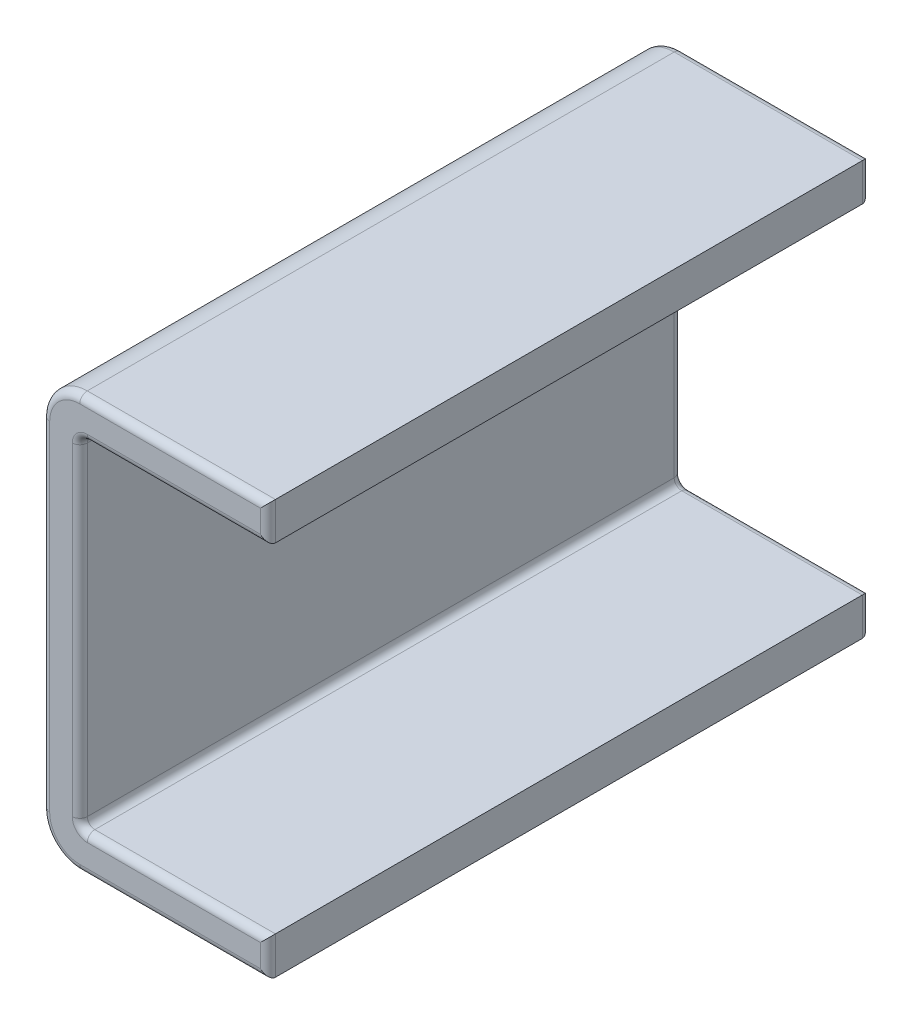
ISO-10303-21;
HEADER;
FILE_DESCRIPTION(('STEP AP214'),'2;1');
FILE_NAME('part.step','',(''),(''),'','','');
FILE_SCHEMA(('AUTOMOTIVE_DESIGN { 1 0 10303 214 1 1 1 1 }'));
ENDSEC;
DATA;
#1=APPLICATION_CONTEXT('core data for automotive mechanical design processes');
#2=APPLICATION_PROTOCOL_DEFINITION('international standard','automotive_design',2000,#1);
#3=PRODUCT_CONTEXT('',#1,'mechanical');
#4=PRODUCT('Part','Part','',(#3));
#5=PRODUCT_RELATED_PRODUCT_CATEGORY('part','',(#4));
#6=PRODUCT_DEFINITION_FORMATION('','',#4);
#7=PRODUCT_DEFINITION_CONTEXT('part definition',#1,'design');
#8=PRODUCT_DEFINITION('design','',#6,#7);
#9=PRODUCT_DEFINITION_SHAPE('','',#8);
#10=(LENGTH_UNIT() NAMED_UNIT(*) SI_UNIT(.MILLI.,.METRE.));
#11=(NAMED_UNIT(*) PLANE_ANGLE_UNIT() SI_UNIT($,.RADIAN.));
#12=(NAMED_UNIT(*) SI_UNIT($,.STERADIAN.) SOLID_ANGLE_UNIT());
#13=UNCERTAINTY_MEASURE_WITH_UNIT(LENGTH_MEASURE(1.E-05),#10,'distance_accuracy_value','');
#14=(GEOMETRIC_REPRESENTATION_CONTEXT(3) GLOBAL_UNCERTAINTY_ASSIGNED_CONTEXT((#13)) GLOBAL_UNIT_ASSIGNED_CONTEXT((#10,
#11,#12)) REPRESENTATION_CONTEXT('',''));
#15=CARTESIAN_POINT('',(0.,0.,0.));
#16=DIRECTION('',(0.,0.,1.));
#17=DIRECTION('',(1.,0.,0.));
#18=AXIS2_PLACEMENT_3D('',#15,#16,#17);
#19=CARTESIAN_POINT('',(-0.273602376485,0.,0.));
#20=DIRECTION('',(0.,-1.,0.));
#21=DIRECTION('',(0.,0.,-1.));
#22=AXIS2_PLACEMENT_3D('',#19,#20,#21);
#23=PLANE('',#22);
#24=DIRECTION('',(1.,0.,0.));
#25=VECTOR('',#24,1.);
#26=CARTESIAN_POINT('',(-0.221329649212,0.,0.79));
#27=LINE('',#26,#25);
#28=CARTESIAN_POINT('',(-0.223602376485,0.,0.79));
#29=VERTEX_POINT('',#28);
#30=CARTESIAN_POINT('',(0.02639762351484,0.,0.79));
#31=VERTEX_POINT('',#30);
#32=EDGE_CURVE('E263',#29,#31,#27,.T.);
#33=ORIENTED_EDGE('',*,*,#32,.F.);
#34=DIRECTION('',(0.,0.,1.));
#35=VECTOR('',#34,1.);
#36=CARTESIAN_POINT('',(-0.223602376485,0.,0.));
#37=LINE('',#36,#35);
#38=CARTESIAN_POINT('',(-0.223602376485,0.,0.01));
#39=VERTEX_POINT('',#38);
#40=EDGE_CURVE('E370',#39,#29,#37,.T.);
#41=ORIENTED_EDGE('',*,*,#40,.F.);
#42=DIRECTION('',(-1.,0.,0.));
#43=VECTOR('',#42,1.);
#44=CARTESIAN_POINT('',(-0.221329649212,0.,0.01));
#45=LINE('',#44,#43);
#46=CARTESIAN_POINT('',(0.02639762351484,0.,0.01));
#47=VERTEX_POINT('',#46);
#48=EDGE_CURVE('E265',#47,#39,#45,.T.);
#49=ORIENTED_EDGE('',*,*,#48,.F.);
#50=DIRECTION('',(0.,0.,1.));
#51=VECTOR('',#50,1.);
#52=CARTESIAN_POINT('',(0.02639762351484,0.,0.));
#53=LINE('',#52,#51);
#54=EDGE_CURVE('E11',#47,#31,#53,.T.);
#55=ORIENTED_EDGE('',*,*,#54,.T.);
#56=EDGE_LOOP('',(#33,#41,#49,#55));
#57=FACE_BOUND('',#56,.T.);
#58=ADVANCED_FACE('F17',(#57),#23,.T.);
#59=CARTESIAN_POINT('',(0.02639762351484,0.,0.));
#60=DIRECTION('',(1.,0.,0.));
#61=DIRECTION('',(0.,1.,0.));
#62=AXIS2_PLACEMENT_3D('',#59,#60,#61);
#63=PLANE('',#62);
#64=DIRECTION('',(0.,1.,0.));
#65=VECTOR('',#64,1.);
#66=CARTESIAN_POINT('',(0.02639762351484,0.1375,0.79));
#67=LINE('',#66,#65);
#68=CARTESIAN_POINT('',(0.02639762351484,0.05,0.79));
#69=VERTEX_POINT('',#68);
#70=EDGE_CURVE('E401',#31,#69,#67,.T.);
#71=ORIENTED_EDGE('',*,*,#70,.F.);
#72=ORIENTED_EDGE('',*,*,#54,.F.);
#73=DIRECTION('',(0.,-1.,0.));
#74=VECTOR('',#73,1.);
#75=CARTESIAN_POINT('',(0.02639762351484,0.1375,0.01));
#76=LINE('',#75,#74);
#77=CARTESIAN_POINT('',(0.02639762351484,0.05,0.01));
#78=VERTEX_POINT('',#77);
#79=EDGE_CURVE('E260',#78,#47,#76,.T.);
#80=ORIENTED_EDGE('',*,*,#79,.F.);
#81=DIRECTION('',(0.,0.,1.));
#82=VECTOR('',#81,1.);
#83=CARTESIAN_POINT('',(0.02639762351484,0.05,0.));
#84=LINE('',#83,#82);
#85=EDGE_CURVE('E28',#78,#69,#84,.T.);
#86=ORIENTED_EDGE('',*,*,#85,.T.);
#87=EDGE_LOOP('',(#71,#72,#80,#86));
#88=FACE_BOUND('',#87,.T.);
#89=ADVANCED_FACE('F671',(#88),#63,.T.);
#90=CARTESIAN_POINT('',(0.02639762351484,0.05,0.));
#91=DIRECTION('',(0.,1.,0.));
#92=DIRECTION('',(1.,0.,0.));
#93=AXIS2_PLACEMENT_3D('',#90,#91,#92);
#94=PLANE('',#93);
#95=DIRECTION('',(-1.,0.,0.));
#96=VECTOR('',#95,1.);
#97=CARTESIAN_POINT('',(-0.07132964921243,0.05,0.79));
#98=LINE('',#97,#96);
#99=CARTESIAN_POINT('',(-0.213602376485,0.05,0.79));
#100=VERTEX_POINT('',#99);
#101=EDGE_CURVE('E316',#69,#100,#98,.T.);
#102=ORIENTED_EDGE('',*,*,#101,.F.);
#103=ORIENTED_EDGE('',*,*,#85,.F.);
#104=DIRECTION('',(1.,0.,0.));
#105=VECTOR('',#104,1.);
#106=CARTESIAN_POINT('',(-0.07132964921243,0.05,0.01));
#107=LINE('',#106,#105);
#108=CARTESIAN_POINT('',(-0.213602376485,0.05,0.01));
#109=VERTEX_POINT('',#108);
#110=EDGE_CURVE('E344',#109,#78,#107,.T.);
#111=ORIENTED_EDGE('',*,*,#110,.F.);
#112=DIRECTION('',(0.,0.,-1.));
#113=VECTOR('',#112,1.);
#114=CARTESIAN_POINT('',(-0.213602376485,0.05,0.));
#115=LINE('',#114,#113);
#116=EDGE_CURVE('E308',#100,#109,#115,.T.);
#117=ORIENTED_EDGE('',*,*,#116,.F.);
#118=EDGE_LOOP('',(#102,#103,#111,#117));
#119=FACE_BOUND('',#118,.T.);
#120=ADVANCED_FACE('F585',(#119),#94,.T.);
#121=CARTESIAN_POINT('',(-0.16905692194,0.275,0.));
#122=DIRECTION('',(0.,0.,1.));
#123=DIRECTION('',(1.,0.,0.));
#124=AXIS2_PLACEMENT_3D('',#121,#122,#123);
#125=PLANE('',#124);
#126=DIRECTION('',(-1.,0.,0.));
#127=VECTOR('',#126,1.);
#128=CARTESIAN_POINT('',(-0.07132964921243,0.54,0.));
#129=LINE('',#128,#127);
#130=CARTESIAN_POINT('',(0.01639762351484,0.54,0.));
#131=VERTEX_POINT('',#130);
#132=CARTESIAN_POINT('',(-0.223602376485,0.54,0.));
#133=VERTEX_POINT('',#132);
#134=EDGE_CURVE('E271',#131,#133,#129,.T.);
#135=ORIENTED_EDGE('',*,*,#134,.F.);
#136=DIRECTION('',(0.,1.,0.));
#137=VECTOR('',#136,1.);
#138=CARTESIAN_POINT('',(0.01639762351484,0.3875,0.));
#139=LINE('',#138,#137);
#140=CARTESIAN_POINT('',(0.01639762351484,0.51,0.));
#141=VERTEX_POINT('',#140);
#142=EDGE_CURVE('E374',#141,#131,#139,.T.);
#143=ORIENTED_EDGE('',*,*,#142,.F.);
#144=DIRECTION('',(1.,0.,0.));
#145=VECTOR('',#144,1.);
#146=CARTESIAN_POINT('',(-0.196329649212,0.51,0.));
#147=LINE('',#146,#145);
#148=CARTESIAN_POINT('',(-0.213602376485,0.51,0.));
#149=VERTEX_POINT('',#148);
#150=EDGE_CURVE('E280',#149,#141,#147,.T.);
#151=ORIENTED_EDGE('',*,*,#150,.F.);
#152=CARTESIAN_POINT('',(-0.213602376485,0.49,0.));
#153=DIRECTION('',(0.,0.,-1.));
#154=DIRECTION('',(-0.707106781186548,0.707106781186548,0.));
#155=AXIS2_PLACEMENT_3D('',#152,#153,#154);
#156=CIRCLE('',#155,0.02);
#157=CARTESIAN_POINT('',(-0.233602376485,0.49,0.));
#158=VERTEX_POINT('',#157);
#159=EDGE_CURVE('E347',#158,#149,#156,.T.);
#160=ORIENTED_EDGE('',*,*,#159,.F.);
#161=DIRECTION('',(0.,1.,0.));
#162=VECTOR('',#161,1.);
#163=CARTESIAN_POINT('',(-0.233602376485,0.1625,0.));
#164=LINE('',#163,#162);
#165=CARTESIAN_POINT('',(-0.233602376485,0.06,0.));
#166=VERTEX_POINT('',#165);
#167=EDGE_CURVE('E383',#166,#158,#164,.T.);
#168=ORIENTED_EDGE('',*,*,#167,.F.);
#169=CARTESIAN_POINT('',(-0.213602376485,0.06,0.));
#170=DIRECTION('',(0.,0.,-1.));
#171=DIRECTION('',(-0.707106781186548,-0.707106781186548,0.));
#172=AXIS2_PLACEMENT_3D('',#169,#170,#171);
#173=CIRCLE('',#172,0.02);
#174=CARTESIAN_POINT('',(-0.213602376485,0.04,0.));
#175=VERTEX_POINT('',#174);
#176=EDGE_CURVE('E285',#175,#166,#173,.T.);
#177=ORIENTED_EDGE('',*,*,#176,.F.);
#178=DIRECTION('',(-1.,0.,0.));
#179=VECTOR('',#178,1.);
#180=CARTESIAN_POINT('',(-0.07132964921243,0.04,0.));
#181=LINE('',#180,#179);
#182=CARTESIAN_POINT('',(0.01639762351484,0.04,0.));
#183=VERTEX_POINT('',#182);
#184=EDGE_CURVE('E303',#183,#175,#181,.T.);
#185=ORIENTED_EDGE('',*,*,#184,.F.);
#186=DIRECTION('',(0.,1.,0.));
#187=VECTOR('',#186,1.);
#188=CARTESIAN_POINT('',(0.01639762351484,0.1375,0.));
#189=LINE('',#188,#187);
#190=CARTESIAN_POINT('',(0.01639762351484,0.01,0.));
#191=VERTEX_POINT('',#190);
#192=EDGE_CURVE('E255',#191,#183,#189,.T.);
#193=ORIENTED_EDGE('',*,*,#192,.F.);
#194=DIRECTION('',(1.,0.,0.));
#195=VECTOR('',#194,1.);
#196=CARTESIAN_POINT('',(-0.221329649212,0.01,0.));
#197=LINE('',#196,#195);
#198=CARTESIAN_POINT('',(-0.223602376485,0.01,0.));
#199=VERTEX_POINT('',#198);
#200=EDGE_CURVE('E269',#199,#191,#197,.T.);
#201=ORIENTED_EDGE('',*,*,#200,.F.);
#202=CARTESIAN_POINT('',(-0.223602376485,0.05,0.));
#203=DIRECTION('',(0.,0.,1.));
#204=DIRECTION('',(-0.707106781186548,-0.707106781186548,0.));
#205=AXIS2_PLACEMENT_3D('',#202,#203,#204);
#206=CIRCLE('',#205,0.04);
#207=CARTESIAN_POINT('',(-0.263602376485,0.05,0.));
#208=VERTEX_POINT('',#207);
#209=EDGE_CURVE('E270',#208,#199,#206,.T.);
#210=ORIENTED_EDGE('',*,*,#209,.F.);
#211=DIRECTION('',(0.,-1.,0.));
#212=VECTOR('',#211,1.);
#213=CARTESIAN_POINT('',(-0.263602376485,0.4125,0.));
#214=LINE('',#213,#212);
#215=CARTESIAN_POINT('',(-0.263602376485,0.5,0.));
#216=VERTEX_POINT('',#215);
#217=EDGE_CURVE('E410',#216,#208,#214,.T.);
#218=ORIENTED_EDGE('',*,*,#217,.F.);
#219=CARTESIAN_POINT('',(-0.223602376485,0.5,0.));
#220=DIRECTION('',(0.,0.,1.));
#221=DIRECTION('',(-0.707106781186548,0.707106781186548,0.));
#222=AXIS2_PLACEMENT_3D('',#219,#220,#221);
#223=CIRCLE('',#222,0.04);
#224=EDGE_CURVE('E366',#133,#216,#223,.T.);
#225=ORIENTED_EDGE('',*,*,#224,.F.);
#226=EDGE_LOOP('',(#135,#143,#151,#160,#168,#177,#185,#193,#201,#210,#218,#225));
#227=FACE_BOUND('',#226,.T.);
#228=ADVANCED_FACE('F516',(#227),#125,.F.);
#229=CARTESIAN_POINT('',(-0.223602376485,0.05,0.));
#230=DIRECTION('',(1.,0.,0.));
#231=DIRECTION('',(0.,1.,0.));
#232=AXIS2_PLACEMENT_3D('',#229,#230,#231);
#233=PLANE('',#232);
#234=DIRECTION('',(0.,-1.,0.));
#235=VECTOR('',#234,1.);
#236=CARTESIAN_POINT('',(-0.223602376485,0.1625,0.01));
#237=LINE('',#236,#235);
#238=CARTESIAN_POINT('',(-0.223602376485,0.49,0.01));
#239=VERTEX_POINT('',#238);
#240=CARTESIAN_POINT('',(-0.223602376485,0.06,0.01));
#241=VERTEX_POINT('',#240);
#242=EDGE_CURVE('E379',#239,#241,#237,.T.);
#243=ORIENTED_EDGE('',*,*,#242,.F.);
#244=DIRECTION('',(0.,0.,-1.));
#245=VECTOR('',#244,1.);
#246=CARTESIAN_POINT('',(-0.223602376485,0.49,0.));
#247=LINE('',#246,#245);
#248=CARTESIAN_POINT('',(-0.223602376485,0.49,0.79));
#249=VERTEX_POINT('',#248);
#250=EDGE_CURVE('E309',#249,#239,#247,.T.);
#251=ORIENTED_EDGE('',*,*,#250,.F.);
#252=DIRECTION('',(0.,1.,0.));
#253=VECTOR('',#252,1.);
#254=CARTESIAN_POINT('',(-0.223602376485,0.1625,0.79));
#255=LINE('',#254,#253);
#256=CARTESIAN_POINT('',(-0.223602376485,0.06,0.79));
#257=VERTEX_POINT('',#256);
#258=EDGE_CURVE('E314',#257,#249,#255,.T.);
#259=ORIENTED_EDGE('',*,*,#258,.F.);
#260=DIRECTION('',(0.,0.,1.));
#261=VECTOR('',#260,1.);
#262=CARTESIAN_POINT('',(-0.223602376485,0.06,0.));
#263=LINE('',#262,#261);
#264=EDGE_CURVE('E223',#241,#257,#263,.T.);
#265=ORIENTED_EDGE('',*,*,#264,.F.);
#266=EDGE_LOOP('',(#243,#251,#259,#265));
#267=FACE_BOUND('',#266,.T.);
#268=ADVANCED_FACE('F498',(#267),#233,.T.);
#269=CARTESIAN_POINT('',(-0.16905692194,0.275,0.8));
#270=DIRECTION('',(0.,0.,1.));
#271=DIRECTION('',(1.,0.,0.));
#272=AXIS2_PLACEMENT_3D('',#269,#270,#271);
#273=PLANE('',#272);
#274=CARTESIAN_POINT('',(-0.213602376485,0.49,0.8));
#275=DIRECTION('',(0.,0.,1.));
#276=DIRECTION('',(-0.707106781186548,0.707106781186548,0.));
#277=AXIS2_PLACEMENT_3D('',#274,#275,#276);
#278=CIRCLE('',#277,0.02);
#279=CARTESIAN_POINT('',(-0.213602376485,0.51,0.8));
#280=VERTEX_POINT('',#279);
#281=CARTESIAN_POINT('',(-0.233602376485,0.49,0.8));
#282=VERTEX_POINT('',#281);
#283=EDGE_CURVE('E226',#280,#282,#278,.T.);
#284=ORIENTED_EDGE('',*,*,#283,.F.);
#285=DIRECTION('',(-1.,0.,0.));
#286=VECTOR('',#285,1.);
#287=CARTESIAN_POINT('',(-0.196329649212,0.51,0.8));
#288=LINE('',#287,#286);
#289=CARTESIAN_POINT('',(0.01639762351484,0.51,0.8));
#290=VERTEX_POINT('',#289);
#291=EDGE_CURVE('E209',#290,#280,#288,.T.);
#292=ORIENTED_EDGE('',*,*,#291,.F.);
#293=DIRECTION('',(0.,-1.,0.));
#294=VECTOR('',#293,1.);
#295=CARTESIAN_POINT('',(0.01639762351484,0.3875,0.8));
#296=LINE('',#295,#294);
#297=CARTESIAN_POINT('',(0.01639762351484,0.54,0.8));
#298=VERTEX_POINT('',#297);
#299=EDGE_CURVE('E293',#298,#290,#296,.T.);
#300=ORIENTED_EDGE('',*,*,#299,.F.);
#301=DIRECTION('',(1.,0.,0.));
#302=VECTOR('',#301,1.);
#303=CARTESIAN_POINT('',(-0.07132964921243,0.54,0.8));
#304=LINE('',#303,#302);
#305=CARTESIAN_POINT('',(-0.223602376485,0.54,0.8));
#306=VERTEX_POINT('',#305);
#307=EDGE_CURVE('E416',#306,#298,#304,.T.);
#308=ORIENTED_EDGE('',*,*,#307,.F.);
#309=CARTESIAN_POINT('',(-0.223602376485,0.5,0.8));
#310=DIRECTION('',(0.,0.,-1.));
#311=DIRECTION('',(-0.707106781186548,0.707106781186548,0.));
#312=AXIS2_PLACEMENT_3D('',#309,#310,#311);
#313=CIRCLE('',#312,0.04);
#314=CARTESIAN_POINT('',(-0.263602376485,0.5,0.8));
#315=VERTEX_POINT('',#314);
#316=EDGE_CURVE('E357',#315,#306,#313,.T.);
#317=ORIENTED_EDGE('',*,*,#316,.F.);
#318=DIRECTION('',(0.,1.,0.));
#319=VECTOR('',#318,1.);
#320=CARTESIAN_POINT('',(-0.263602376485,0.4125,0.8));
#321=LINE('',#320,#319);
#322=CARTESIAN_POINT('',(-0.263602376485,0.05,0.8));
#323=VERTEX_POINT('',#322);
#324=EDGE_CURVE('E340',#323,#315,#321,.T.);
#325=ORIENTED_EDGE('',*,*,#324,.F.);
#326=CARTESIAN_POINT('',(-0.223602376485,0.05,0.8));
#327=DIRECTION('',(0.,0.,-1.));
#328=DIRECTION('',(-0.707106781186548,-0.707106781186548,0.));
#329=AXIS2_PLACEMENT_3D('',#326,#327,#328);
#330=CIRCLE('',#329,0.04);
#331=CARTESIAN_POINT('',(-0.223602376485,0.01,0.8));
#332=VERTEX_POINT('',#331);
#333=EDGE_CURVE('E281',#332,#323,#330,.T.);
#334=ORIENTED_EDGE('',*,*,#333,.F.);
#335=DIRECTION('',(-1.,0.,0.));
#336=VECTOR('',#335,1.);
#337=CARTESIAN_POINT('',(-0.221329649212,0.01,0.8));
#338=LINE('',#337,#336);
#339=CARTESIAN_POINT('',(0.01639762351484,0.01,0.8));
#340=VERTEX_POINT('',#339);
#341=EDGE_CURVE('E42',#340,#332,#338,.T.);
#342=ORIENTED_EDGE('',*,*,#341,.F.);
#343=DIRECTION('',(0.,-1.,0.));
#344=VECTOR('',#343,1.);
#345=CARTESIAN_POINT('',(0.01639762351484,0.1375,0.8));
#346=LINE('',#345,#344);
#347=CARTESIAN_POINT('',(0.01639762351484,0.04,0.8));
#348=VERTEX_POINT('',#347);
#349=EDGE_CURVE('E459',#348,#340,#346,.T.);
#350=ORIENTED_EDGE('',*,*,#349,.F.);
#351=DIRECTION('',(1.,0.,0.));
#352=VECTOR('',#351,1.);
#353=CARTESIAN_POINT('',(-0.07132964921243,0.04,0.8));
#354=LINE('',#353,#352);
#355=CARTESIAN_POINT('',(-0.213602376485,0.04,0.8));
#356=VERTEX_POINT('',#355);
#357=EDGE_CURVE('E402',#356,#348,#354,.T.);
#358=ORIENTED_EDGE('',*,*,#357,.F.);
#359=CARTESIAN_POINT('',(-0.213602376485,0.06,0.8));
#360=DIRECTION('',(0.,0.,1.));
#361=DIRECTION('',(-0.707106781186548,-0.707106781186548,0.));
#362=AXIS2_PLACEMENT_3D('',#359,#360,#361);
#363=CIRCLE('',#362,0.02);
#364=CARTESIAN_POINT('',(-0.233602376485,0.06,0.8));
#365=VERTEX_POINT('',#364);
#366=EDGE_CURVE('E310',#365,#356,#363,.T.);
#367=ORIENTED_EDGE('',*,*,#366,.F.);
#368=DIRECTION('',(0.,-1.,0.));
#369=VECTOR('',#368,1.);
#370=CARTESIAN_POINT('',(-0.233602376485,0.1625,0.8));
#371=LINE('',#370,#369);
#372=EDGE_CURVE('E229',#282,#365,#371,.T.);
#373=ORIENTED_EDGE('',*,*,#372,.F.);
#374=EDGE_LOOP('',(#284,#292,#300,#308,#317,#325,#334,#342,#350,#358,#367,#373));
#375=FACE_BOUND('',#374,.T.);
#376=ADVANCED_FACE('F227',(#375),#273,.T.);
#377=CARTESIAN_POINT('',(0.02639762351484,0.55,0.));
#378=DIRECTION('',(0.,1.,0.));
#379=DIRECTION('',(1.,0.,0.));
#380=AXIS2_PLACEMENT_3D('',#377,#378,#379);
#381=PLANE('',#380);
#382=DIRECTION('',(-1.,0.,0.));
#383=VECTOR('',#382,1.);
#384=CARTESIAN_POINT('',(-0.07132964921243,0.55,0.79));
#385=LINE('',#384,#383);
#386=CARTESIAN_POINT('',(0.02639762351484,0.55,0.79));
#387=VERTEX_POINT('',#386);
#388=CARTESIAN_POINT('',(-0.223602376485,0.55,0.79));
#389=VERTEX_POINT('',#388);
#390=EDGE_CURVE('E390',#387,#389,#385,.T.);
#391=ORIENTED_EDGE('',*,*,#390,.F.);
#392=DIRECTION('',(0.,0.,1.));
#393=VECTOR('',#392,1.);
#394=CARTESIAN_POINT('',(0.02639762351484,0.55,0.));
#395=LINE('',#394,#393);
#396=CARTESIAN_POINT('',(0.02639762351484,0.55,0.01));
#397=VERTEX_POINT('',#396);
#398=EDGE_CURVE('E352',#397,#387,#395,.T.);
#399=ORIENTED_EDGE('',*,*,#398,.F.);
#400=DIRECTION('',(1.,0.,0.));
#401=VECTOR('',#400,1.);
#402=CARTESIAN_POINT('',(-0.07132964921243,0.55,0.01));
#403=LINE('',#402,#401);
#404=CARTESIAN_POINT('',(-0.223602376485,0.55,0.01));
#405=VERTEX_POINT('',#404);
#406=EDGE_CURVE('E299',#405,#397,#403,.T.);
#407=ORIENTED_EDGE('',*,*,#406,.F.);
#408=DIRECTION('',(0.,0.,-1.));
#409=VECTOR('',#408,1.);
#410=CARTESIAN_POINT('',(-0.223602376485,0.55,0.));
#411=LINE('',#410,#409);
#412=EDGE_CURVE('E355',#389,#405,#411,.T.);
#413=ORIENTED_EDGE('',*,*,#412,.F.);
#414=EDGE_LOOP('',(#391,#399,#407,#413));
#415=FACE_BOUND('',#414,.T.);
#416=ADVANCED_FACE('F655',(#415),#381,.T.);
#417=CARTESIAN_POINT('',(-0.223602376485,0.5,0.));
#418=DIRECTION('',(0.,0.,1.));
#419=DIRECTION('',(-0.707106781186548,0.707106781186548,0.));
#420=AXIS2_PLACEMENT_3D('',#417,#418,#419);
#421=CYLINDRICAL_SURFACE('',#420,0.05);
#422=CARTESIAN_POINT('',(-0.223602376485,0.5,0.79));
#423=DIRECTION('',(0.,0.,1.));
#424=DIRECTION('',(-0.707106781186548,0.707106781186548,0.));
#425=AXIS2_PLACEMENT_3D('',#422,#423,#424);
#426=CIRCLE('',#425,0.05);
#427=CARTESIAN_POINT('',(-0.273602376485,0.5,0.79));
#428=VERTEX_POINT('',#427);
#429=EDGE_CURVE('E360',#389,#428,#426,.T.);
#430=ORIENTED_EDGE('',*,*,#429,.F.);
#431=ORIENTED_EDGE('',*,*,#412,.T.);
#432=CARTESIAN_POINT('',(-0.223602376485,0.5,0.01));
#433=DIRECTION('',(0.,0.,-1.));
#434=DIRECTION('',(-0.707106781186548,0.707106781186548,0.));
#435=AXIS2_PLACEMENT_3D('',#432,#433,#434);
#436=CIRCLE('',#435,0.05);
#437=CARTESIAN_POINT('',(-0.273602376485,0.5,0.01));
#438=VERTEX_POINT('',#437);
#439=EDGE_CURVE('E362',#438,#405,#436,.T.);
#440=ORIENTED_EDGE('',*,*,#439,.F.);
#441=DIRECTION('',(0.,0.,1.));
#442=VECTOR('',#441,1.);
#443=CARTESIAN_POINT('',(-0.273602376485,0.5,0.));
#444=LINE('',#443,#442);
#445=EDGE_CURVE('E356',#438,#428,#444,.T.);
#446=ORIENTED_EDGE('',*,*,#445,.T.);
#447=EDGE_LOOP('',(#430,#431,#440,#446));
#448=FACE_BOUND('',#447,.T.);
#449=ADVANCED_FACE('F617',(#448),#421,.T.);
#450=CARTESIAN_POINT('',(0.02639762351484,0.5,0.));
#451=DIRECTION('',(1.,0.,0.));
#452=DIRECTION('',(0.,1.,0.));
#453=AXIS2_PLACEMENT_3D('',#450,#451,#452);
#454=PLANE('',#453);
#455=DIRECTION('',(0.,1.,0.));
#456=VECTOR('',#455,1.);
#457=CARTESIAN_POINT('',(0.02639762351484,0.3875,0.79));
#458=LINE('',#457,#456);
#459=CARTESIAN_POINT('',(0.02639762351484,0.5,0.79));
#460=VERTEX_POINT('',#459);
#461=EDGE_CURVE('E292',#460,#387,#458,.T.);
#462=ORIENTED_EDGE('',*,*,#461,.F.);
#463=DIRECTION('',(0.,0.,1.));
#464=VECTOR('',#463,1.);
#465=CARTESIAN_POINT('',(0.02639762351484,0.5,0.));
#466=LINE('',#465,#464);
#467=CARTESIAN_POINT('',(0.02639762351484,0.5,0.01));
#468=VERTEX_POINT('',#467);
#469=EDGE_CURVE('E371',#468,#460,#466,.T.);
#470=ORIENTED_EDGE('',*,*,#469,.F.);
#471=DIRECTION('',(0.,-1.,0.));
#472=VECTOR('',#471,1.);
#473=CARTESIAN_POINT('',(0.02639762351484,0.3875,0.01));
#474=LINE('',#473,#472);
#475=EDGE_CURVE('E377',#397,#468,#474,.T.);
#476=ORIENTED_EDGE('',*,*,#475,.F.);
#477=ORIENTED_EDGE('',*,*,#398,.T.);
#478=EDGE_LOOP('',(#462,#470,#476,#477));
#479=FACE_BOUND('',#478,.T.);
#480=ADVANCED_FACE('F902',(#479),#454,.T.);
#481=CARTESIAN_POINT('',(-0.273602376485,0.55,0.));
#482=DIRECTION('',(-1.,0.,0.));
#483=DIRECTION('',(0.,1.,0.));
#484=AXIS2_PLACEMENT_3D('',#481,#482,#483);
#485=PLANE('',#484);
#486=DIRECTION('',(0.,-1.,0.));
#487=VECTOR('',#486,1.);
#488=CARTESIAN_POINT('',(-0.273602376485,0.4125,0.79));
#489=LINE('',#488,#487);
#490=CARTESIAN_POINT('',(-0.273602376485,0.05,0.79));
#491=VERTEX_POINT('',#490);
#492=EDGE_CURVE('E337',#428,#491,#489,.T.);
#493=ORIENTED_EDGE('',*,*,#492,.F.);
#494=ORIENTED_EDGE('',*,*,#445,.F.);
#495=DIRECTION('',(0.,1.,0.));
#496=VECTOR('',#495,1.);
#497=CARTESIAN_POINT('',(-0.273602376485,0.4125,0.01));
#498=LINE('',#497,#496);
#499=CARTESIAN_POINT('',(-0.273602376485,0.05,0.01));
#500=VERTEX_POINT('',#499);
#501=EDGE_CURVE('E406',#500,#438,#498,.T.);
#502=ORIENTED_EDGE('',*,*,#501,.F.);
#503=DIRECTION('',(0.,0.,-1.));
#504=VECTOR('',#503,1.);
#505=CARTESIAN_POINT('',(-0.273602376485,0.05,0.));
#506=LINE('',#505,#504);
#507=EDGE_CURVE('E367',#491,#500,#506,.T.);
#508=ORIENTED_EDGE('',*,*,#507,.F.);
#509=EDGE_LOOP('',(#493,#494,#502,#508));
#510=FACE_BOUND('',#509,.T.);
#511=ADVANCED_FACE('F610',(#510),#485,.T.);
#512=CARTESIAN_POINT('',(-0.223602376485,0.05,0.));
#513=DIRECTION('',(0.,0.,1.));
#514=DIRECTION('',(-0.707106781186548,-0.707106781186548,0.));
#515=AXIS2_PLACEMENT_3D('',#512,#513,#514);
#516=CYLINDRICAL_SURFACE('',#515,0.05);
#517=CARTESIAN_POINT('',(-0.223602376485,0.05,0.79));
#518=DIRECTION('',(0.,0.,1.));
#519=DIRECTION('',(-0.707106781186548,-0.707106781186548,0.));
#520=AXIS2_PLACEMENT_3D('',#517,#518,#519);
#521=CIRCLE('',#520,0.05);
#522=EDGE_CURVE('E264',#491,#29,#521,.T.);
#523=ORIENTED_EDGE('',*,*,#522,.F.);
#524=ORIENTED_EDGE('',*,*,#507,.T.);
#525=CARTESIAN_POINT('',(-0.223602376485,0.05,0.01));
#526=DIRECTION('',(0.,0.,-1.));
#527=DIRECTION('',(-0.707106781186548,-0.707106781186548,0.));
#528=AXIS2_PLACEMENT_3D('',#525,#526,#527);
#529=CIRCLE('',#528,0.05);
#530=EDGE_CURVE('E476',#39,#500,#529,.T.);
#531=ORIENTED_EDGE('',*,*,#530,.F.);
#532=ORIENTED_EDGE('',*,*,#40,.T.);
#533=EDGE_LOOP('',(#523,#524,#531,#532));
#534=FACE_BOUND('',#533,.T.);
#535=ADVANCED_FACE('F603',(#534),#516,.T.);
#536=CARTESIAN_POINT('',(-0.223602376485,0.5,0.));
#537=DIRECTION('',(0.,-1.,0.));
#538=DIRECTION('',(0.,0.,-1.));
#539=AXIS2_PLACEMENT_3D('',#536,#537,#538);
#540=PLANE('',#539);
#541=DIRECTION('',(1.,0.,0.));
#542=VECTOR('',#541,1.);
#543=CARTESIAN_POINT('',(-0.196329649212,0.5,0.79));
#544=LINE('',#543,#542);
#545=CARTESIAN_POINT('',(-0.213602376485,0.5,0.79));
#546=VERTEX_POINT('',#545);
#547=EDGE_CURVE('E222',#546,#460,#544,.T.);
#548=ORIENTED_EDGE('',*,*,#547,.F.);
#549=DIRECTION('',(0.,0.,1.));
#550=VECTOR('',#549,1.);
#551=CARTESIAN_POINT('',(-0.213602376485,0.5,0.));
#552=LINE('',#551,#550);
#553=CARTESIAN_POINT('',(-0.213602376485,0.5,0.01));
#554=VERTEX_POINT('',#553);
#555=EDGE_CURVE('E304',#554,#546,#552,.T.);
#556=ORIENTED_EDGE('',*,*,#555,.F.);
#557=DIRECTION('',(-1.,0.,0.));
#558=VECTOR('',#557,1.);
#559=CARTESIAN_POINT('',(-0.196329649212,0.5,0.01));
#560=LINE('',#559,#558);
#561=EDGE_CURVE('E436',#468,#554,#560,.T.);
#562=ORIENTED_EDGE('',*,*,#561,.F.);
#563=ORIENTED_EDGE('',*,*,#469,.T.);
#564=EDGE_LOOP('',(#548,#556,#562,#563));
#565=FACE_BOUND('',#564,.T.);
#566=ADVANCED_FACE('F505',(#565),#540,.T.);
#567=CARTESIAN_POINT('',(-0.221329649212,0.01,0.79));
#568=DIRECTION('',(1.,0.,0.));
#569=DIRECTION('',(0.,-0.707106781186548,0.707106781186548));
#570=AXIS2_PLACEMENT_3D('',#567,#568,#569);
#571=CYLINDRICAL_SURFACE('',#570,0.01);
#572=ORIENTED_EDGE('',*,*,#341,.T.);
#573=CARTESIAN_POINT('',(-0.223602376485,0.01,0.79));
#574=DIRECTION('',(-1.,0.,0.));
#575=DIRECTION('',(0.,-1.,0.));
#576=AXIS2_PLACEMENT_3D('',#573,#574,#575);
#577=CIRCLE('',#576,0.01);
#578=EDGE_CURVE('E284',#29,#332,#577,.T.);
#579=ORIENTED_EDGE('',*,*,#578,.F.);
#580=ORIENTED_EDGE('',*,*,#32,.T.);
#581=CARTESIAN_POINT('',(0.01639762351484,0.01,0.79));
#582=DIRECTION('',(0.707106781186548,0.707106781186548,0.));
#583=DIRECTION('',(0.707106781186548,-0.707106781186548,0.));
#584=AXIS2_PLACEMENT_3D('',#581,#582,#583);
#585=ELLIPSE('',#584,0.01414213562373,0.01);
#586=EDGE_CURVE('E448',#340,#31,#585,.T.);
#587=ORIENTED_EDGE('',*,*,#586,.F.);
#588=EDGE_LOOP('',(#572,#579,#580,#587));
#589=FACE_BOUND('',#588,.T.);
#590=ADVANCED_FACE('F594',(#589),#571,.T.);
#591=CARTESIAN_POINT('',(-0.223602376485,0.05,0.79));
#592=DIRECTION('',(0.,0.,-1.));
#593=DIRECTION('',(-1.,0.,0.));
#594=AXIS2_PLACEMENT_3D('',#591,#592,#593);
#595=TOROIDAL_SURFACE('',#594,0.04,0.01);
#596=ORIENTED_EDGE('',*,*,#578,.T.);
#597=ORIENTED_EDGE('',*,*,#333,.T.);
#598=CARTESIAN_POINT('',(-0.263602376485,0.05,0.79));
#599=DIRECTION('',(0.,1.,0.));
#600=DIRECTION('',(-1.,0.,0.));
#601=AXIS2_PLACEMENT_3D('',#598,#599,#600);
#602=CIRCLE('',#601,0.01);
#603=EDGE_CURVE('E419',#491,#323,#602,.T.);
#604=ORIENTED_EDGE('',*,*,#603,.F.);
#605=ORIENTED_EDGE('',*,*,#522,.T.);
#606=EDGE_LOOP('',(#596,#597,#604,#605));
#607=FACE_BOUND('',#606,.T.);
#608=ADVANCED_FACE('F601',(#607),#595,.T.);
#609=CARTESIAN_POINT('',(-0.263602376485,0.4125,0.79));
#610=DIRECTION('',(0.,-1.,0.));
#611=DIRECTION('',(-0.707106781186548,0.,0.707106781186548));
#612=AXIS2_PLACEMENT_3D('',#609,#610,#611);
#613=CYLINDRICAL_SURFACE('',#612,0.01);
#614=ORIENTED_EDGE('',*,*,#603,.T.);
#615=ORIENTED_EDGE('',*,*,#324,.T.);
#616=CARTESIAN_POINT('',(-0.263602376485,0.5,0.79));
#617=DIRECTION('',(0.,1.,0.));
#618=DIRECTION('',(-1.,0.,0.));
#619=AXIS2_PLACEMENT_3D('',#616,#617,#618);
#620=CIRCLE('',#619,0.01);
#621=EDGE_CURVE('E361',#428,#315,#620,.T.);
#622=ORIENTED_EDGE('',*,*,#621,.F.);
#623=ORIENTED_EDGE('',*,*,#492,.T.);
#624=EDGE_LOOP('',(#614,#615,#622,#623));
#625=FACE_BOUND('',#624,.T.);
#626=ADVANCED_FACE('F608',(#625),#613,.T.);
#627=CARTESIAN_POINT('',(-0.223602376485,0.5,0.79));
#628=DIRECTION('',(0.,0.,-1.));
#629=DIRECTION('',(-1.,0.,0.));
#630=AXIS2_PLACEMENT_3D('',#627,#628,#629);
#631=TOROIDAL_SURFACE('',#630,0.04,0.01);
#632=ORIENTED_EDGE('',*,*,#621,.T.);
#633=ORIENTED_EDGE('',*,*,#316,.T.);
#634=CARTESIAN_POINT('',(-0.223602376485,0.54,0.79));
#635=DIRECTION('',(1.,0.,0.));
#636=DIRECTION('',(0.,1.,0.));
#637=AXIS2_PLACEMENT_3D('',#634,#635,#636);
#638=CIRCLE('',#637,0.01);
#639=EDGE_CURVE('E393',#389,#306,#638,.T.);
#640=ORIENTED_EDGE('',*,*,#639,.F.);
#641=ORIENTED_EDGE('',*,*,#429,.T.);
#642=EDGE_LOOP('',(#632,#633,#640,#641));
#643=FACE_BOUND('',#642,.T.);
#644=ADVANCED_FACE('F615',(#643),#631,.T.);
#645=CARTESIAN_POINT('',(0.01639762351484,0.1375,0.79));
#646=DIRECTION('',(0.,1.,0.));
#647=DIRECTION('',(0.707106781186548,0.,0.707106781186548));
#648=AXIS2_PLACEMENT_3D('',#645,#646,#647);
#649=CYLINDRICAL_SURFACE('',#648,0.01);
#650=ORIENTED_EDGE('',*,*,#70,.T.);
#651=CARTESIAN_POINT('',(0.01639762351484,0.04,0.79));
#652=DIRECTION('',(-0.707106781186548,0.707106781186548,0.));
#653=DIRECTION('',(0.707106781186548,0.707106781186548,0.));
#654=AXIS2_PLACEMENT_3D('',#651,#652,#653);
#655=ELLIPSE('',#654,0.01414213562373,0.01);
#656=EDGE_CURVE('E397',#348,#69,#655,.T.);
#657=ORIENTED_EDGE('',*,*,#656,.F.);
#658=ORIENTED_EDGE('',*,*,#349,.T.);
#659=ORIENTED_EDGE('',*,*,#586,.T.);
#660=EDGE_LOOP('',(#650,#657,#658,#659));
#661=FACE_BOUND('',#660,.T.);
#662=ADVANCED_FACE('F574',(#661),#649,.T.);
#663=CARTESIAN_POINT('',(-0.07132964921243,0.04,0.79));
#664=DIRECTION('',(-1.,0.,0.));
#665=DIRECTION('',(0.,0.707106781186548,0.707106781186548));
#666=AXIS2_PLACEMENT_3D('',#663,#664,#665);
#667=CYLINDRICAL_SURFACE('',#666,0.01);
#668=ORIENTED_EDGE('',*,*,#101,.T.);
#669=CARTESIAN_POINT('',(-0.213602376485,0.04,0.79));
#670=DIRECTION('',(1.,0.,0.));
#671=DIRECTION('',(0.,1.,0.));
#672=AXIS2_PLACEMENT_3D('',#669,#670,#671);
#673=CIRCLE('',#672,0.01);
#674=EDGE_CURVE('E433',#100,#356,#673,.T.);
#675=ORIENTED_EDGE('',*,*,#674,.T.);
#676=ORIENTED_EDGE('',*,*,#357,.T.);
#677=ORIENTED_EDGE('',*,*,#656,.T.);
#678=EDGE_LOOP('',(#668,#675,#676,#677));
#679=FACE_BOUND('',#678,.T.);
#680=ADVANCED_FACE('F581',(#679),#667,.T.);
#681=CARTESIAN_POINT('',(-0.233602376485,0.1625,0.79));
#682=DIRECTION('',(0.,1.,0.));
#683=DIRECTION('',(0.707106781186548,0.,0.707106781186548));
#684=AXIS2_PLACEMENT_3D('',#681,#682,#683);
#685=CYLINDRICAL_SURFACE('',#684,0.01);
#686=CARTESIAN_POINT('',(-0.233602376485,0.49,0.79));
#687=DIRECTION('',(0.,-1.,0.));
#688=DIRECTION('',(1.,0.,0.));
#689=AXIS2_PLACEMENT_3D('',#686,#687,#688);
#690=CIRCLE('',#689,0.01);
#691=EDGE_CURVE('E245',#249,#282,#690,.T.);
#692=ORIENTED_EDGE('',*,*,#691,.T.);
#693=ORIENTED_EDGE('',*,*,#372,.T.);
#694=CARTESIAN_POINT('',(-0.233602376485,0.06,0.79));
#695=DIRECTION('',(0.,1.,0.));
#696=DIRECTION('',(0.,0.,1.));
#697=AXIS2_PLACEMENT_3D('',#694,#695,#696);
#698=CIRCLE('',#697,0.01);
#699=EDGE_CURVE('E21',#365,#257,#698,.T.);
#700=ORIENTED_EDGE('',*,*,#699,.T.);
#701=ORIENTED_EDGE('',*,*,#258,.T.);
#702=EDGE_LOOP('',(#692,#693,#700,#701));
#703=FACE_BOUND('',#702,.T.);
#704=ADVANCED_FACE('F492',(#703),#685,.T.);
#705=CARTESIAN_POINT('',(-0.196329649212,0.51,0.79));
#706=DIRECTION('',(1.,0.,0.));
#707=DIRECTION('',(0.,-0.707106781186548,0.707106781186548));
#708=AXIS2_PLACEMENT_3D('',#705,#706,#707);
#709=CYLINDRICAL_SURFACE('',#708,0.01);
#710=ORIENTED_EDGE('',*,*,#291,.T.);
#711=CARTESIAN_POINT('',(-0.213602376485,0.51,0.79));
#712=DIRECTION('',(1.,0.,0.));
#713=DIRECTION('',(0.,0.,1.));
#714=AXIS2_PLACEMENT_3D('',#711,#712,#713);
#715=CIRCLE('',#714,0.01);
#716=EDGE_CURVE('E214',#280,#546,#715,.T.);
#717=ORIENTED_EDGE('',*,*,#716,.T.);
#718=ORIENTED_EDGE('',*,*,#547,.T.);
#719=CARTESIAN_POINT('',(0.01639762351484,0.51,0.79));
#720=DIRECTION('',(0.707106781186548,0.707106781186548,0.));
#721=DIRECTION('',(0.707106781186548,-0.707106781186548,0.));
#722=AXIS2_PLACEMENT_3D('',#719,#720,#721);
#723=ELLIPSE('',#722,0.01414213562373,0.01);
#724=EDGE_CURVE('E217',#290,#460,#723,.T.);
#725=ORIENTED_EDGE('',*,*,#724,.F.);
#726=EDGE_LOOP('',(#710,#717,#718,#725));
#727=FACE_BOUND('',#726,.T.);
#728=ADVANCED_FACE('F211',(#727),#709,.T.);
#729=CARTESIAN_POINT('',(-0.213602376485,0.06,0.));
#730=DIRECTION('',(0.,0.,1.));
#731=DIRECTION('',(-0.707106781186548,-0.707106781186548,0.));
#732=AXIS2_PLACEMENT_3D('',#729,#730,#731);
#733=CYLINDRICAL_SURFACE('',#732,0.01);
#734=CARTESIAN_POINT('',(-0.213602376485,0.06,0.79));
#735=DIRECTION('',(0.,0.,-1.));
#736=DIRECTION('',(-1.,0.,0.));
#737=AXIS2_PLACEMENT_3D('',#734,#735,#736);
#738=CIRCLE('',#737,0.01);
#739=EDGE_CURVE('E429',#100,#257,#738,.T.);
#740=ORIENTED_EDGE('',*,*,#739,.F.);
#741=ORIENTED_EDGE('',*,*,#116,.T.);
#742=CARTESIAN_POINT('',(-0.213602376485,0.06,0.01));
#743=DIRECTION('',(0.,0.,1.));
#744=DIRECTION('',(0.,-1.,0.));
#745=AXIS2_PLACEMENT_3D('',#742,#743,#744);
#746=CIRCLE('',#745,0.01);
#747=EDGE_CURVE('E234',#241,#109,#746,.T.);
#748=ORIENTED_EDGE('',*,*,#747,.F.);
#749=ORIENTED_EDGE('',*,*,#264,.T.);
#750=EDGE_LOOP('',(#740,#741,#748,#749));
#751=FACE_BOUND('',#750,.T.);
#752=ADVANCED_FACE('F590',(#751),#733,.F.);
#753=CARTESIAN_POINT('',(-0.213602376485,0.49,0.));
#754=DIRECTION('',(0.,0.,1.));
#755=DIRECTION('',(-0.707106781186548,0.707106781186548,0.));
#756=AXIS2_PLACEMENT_3D('',#753,#754,#755);
#757=CYLINDRICAL_SURFACE('',#756,0.01);
#758=CARTESIAN_POINT('',(-0.213602376485,0.49,0.79));
#759=DIRECTION('',(0.,0.,-1.));
#760=DIRECTION('',(0.,1.,0.));
#761=AXIS2_PLACEMENT_3D('',#758,#759,#760);
#762=CIRCLE('',#761,0.01);
#763=EDGE_CURVE('E238',#249,#546,#762,.T.);
#764=ORIENTED_EDGE('',*,*,#763,.F.);
#765=ORIENTED_EDGE('',*,*,#250,.T.);
#766=CARTESIAN_POINT('',(-0.213602376485,0.49,0.01));
#767=DIRECTION('',(0.,0.,1.));
#768=DIRECTION('',(-1.,0.,0.));
#769=AXIS2_PLACEMENT_3D('',#766,#767,#768);
#770=CIRCLE('',#769,0.01);
#771=EDGE_CURVE('E250',#554,#239,#770,.T.);
#772=ORIENTED_EDGE('',*,*,#771,.F.);
#773=ORIENTED_EDGE('',*,*,#555,.T.);
#774=EDGE_LOOP('',(#764,#765,#772,#773));
#775=FACE_BOUND('',#774,.T.);
#776=ADVANCED_FACE('F502',(#775),#757,.F.);
#777=CARTESIAN_POINT('',(-0.07132964921243,0.04,0.01));
#778=DIRECTION('',(-1.,0.,0.));
#779=DIRECTION('',(0.,0.707106781186548,-0.707106781186548));
#780=AXIS2_PLACEMENT_3D('',#777,#778,#779);
#781=CYLINDRICAL_SURFACE('',#780,0.01);
#782=ORIENTED_EDGE('',*,*,#184,.T.);
#783=CARTESIAN_POINT('',(-0.213602376485,0.04,0.01));
#784=DIRECTION('',(1.,0.,0.));
#785=DIRECTION('',(0.,0.,-1.));
#786=AXIS2_PLACEMENT_3D('',#783,#784,#785);
#787=CIRCLE('',#786,0.01);
#788=EDGE_CURVE('E289',#175,#109,#787,.T.);
#789=ORIENTED_EDGE('',*,*,#788,.T.);
#790=ORIENTED_EDGE('',*,*,#110,.T.);
#791=CARTESIAN_POINT('',(0.01639762351484,0.04,0.01));
#792=DIRECTION('',(0.707106781186548,-0.707106781186548,0.));
#793=DIRECTION('',(-0.707106781186548,-0.707106781186548,0.));
#794=AXIS2_PLACEMENT_3D('',#791,#792,#793);
#795=ELLIPSE('',#794,0.01414213562373,0.01);
#796=EDGE_CURVE('E259',#183,#78,#795,.T.);
#797=ORIENTED_EDGE('',*,*,#796,.F.);
#798=EDGE_LOOP('',(#782,#789,#790,#797));
#799=FACE_BOUND('',#798,.T.);
#800=ADVANCED_FACE('F19',(#799),#781,.T.);
#801=CARTESIAN_POINT('',(0.01639762351484,0.1375,0.01));
#802=DIRECTION('',(0.,1.,0.));
#803=DIRECTION('',(0.707106781186548,0.,-0.707106781186548));
#804=AXIS2_PLACEMENT_3D('',#801,#802,#803);
#805=CYLINDRICAL_SURFACE('',#804,0.01);
#806=ORIENTED_EDGE('',*,*,#79,.T.);
#807=CARTESIAN_POINT('',(0.01639762351484,0.01,0.01));
#808=DIRECTION('',(-0.707106781186548,-0.707106781186548,0.));
#809=DIRECTION('',(-0.707106781186548,0.707106781186548,0.));
#810=AXIS2_PLACEMENT_3D('',#807,#808,#809);
#811=ELLIPSE('',#810,0.01414213562373,0.01);
#812=EDGE_CURVE('E378',#191,#47,#811,.T.);
#813=ORIENTED_EDGE('',*,*,#812,.F.);
#814=ORIENTED_EDGE('',*,*,#192,.T.);
#815=ORIENTED_EDGE('',*,*,#796,.T.);
#816=EDGE_LOOP('',(#806,#813,#814,#815));
#817=FACE_BOUND('',#816,.T.);
#818=ADVANCED_FACE('F696',(#817),#805,.T.);
#819=CARTESIAN_POINT('',(0.01639762351484,0.3875,0.01));
#820=DIRECTION('',(0.,1.,0.));
#821=DIRECTION('',(0.707106781186548,0.,-0.707106781186548));
#822=AXIS2_PLACEMENT_3D('',#819,#820,#821);
#823=CYLINDRICAL_SURFACE('',#822,0.01);
#824=ORIENTED_EDGE('',*,*,#142,.T.);
#825=CARTESIAN_POINT('',(0.01639762351484,0.54,0.01));
#826=DIRECTION('',(-0.707106781186548,0.707106781186548,0.));
#827=DIRECTION('',(0.707106781186548,0.707106781186548,0.));
#828=AXIS2_PLACEMENT_3D('',#825,#826,#827);
#829=ELLIPSE('',#828,0.01414213562373,0.01);
#830=EDGE_CURVE('E294',#397,#131,#829,.T.);
#831=ORIENTED_EDGE('',*,*,#830,.F.);
#832=ORIENTED_EDGE('',*,*,#475,.T.);
#833=CARTESIAN_POINT('',(0.01639762351484,0.51,0.01));
#834=DIRECTION('',(-0.707106781186548,-0.707106781186548,0.));
#835=DIRECTION('',(-0.707106781186548,0.707106781186548,0.));
#836=AXIS2_PLACEMENT_3D('',#833,#834,#835);
#837=ELLIPSE('',#836,0.01414213562373,0.01);
#838=EDGE_CURVE('E276',#141,#468,#837,.T.);
#839=ORIENTED_EDGE('',*,*,#838,.F.);
#840=EDGE_LOOP('',(#824,#831,#832,#839));
#841=FACE_BOUND('',#840,.T.);
#842=ADVANCED_FACE('F522',(#841),#823,.T.);
#843=CARTESIAN_POINT('',(-0.221329649212,0.01,0.01));
#844=DIRECTION('',(1.,0.,0.));
#845=DIRECTION('',(0.,-0.707106781186548,-0.707106781186548));
#846=AXIS2_PLACEMENT_3D('',#843,#844,#845);
#847=CYLINDRICAL_SURFACE('',#846,0.01);
#848=ORIENTED_EDGE('',*,*,#48,.T.);
#849=CARTESIAN_POINT('',(-0.223602376485,0.01,0.01));
#850=DIRECTION('',(-1.,0.,0.));
#851=DIRECTION('',(0.,0.,-1.));
#852=AXIS2_PLACEMENT_3D('',#849,#850,#851);
#853=CIRCLE('',#852,0.01);
#854=EDGE_CURVE('E458',#199,#39,#853,.T.);
#855=ORIENTED_EDGE('',*,*,#854,.F.);
#856=ORIENTED_EDGE('',*,*,#200,.T.);
#857=ORIENTED_EDGE('',*,*,#812,.T.);
#858=EDGE_LOOP('',(#848,#855,#856,#857));
#859=FACE_BOUND('',#858,.T.);
#860=ADVANCED_FACE('F631',(#859),#847,.T.);
#861=CARTESIAN_POINT('',(-0.223602376485,0.05,0.01));
#862=DIRECTION('',(0.,0.,1.));
#863=DIRECTION('',(1.,0.,0.));
#864=AXIS2_PLACEMENT_3D('',#861,#862,#863);
#865=TOROIDAL_SURFACE('',#864,0.04,0.01);
#866=ORIENTED_EDGE('',*,*,#854,.T.);
#867=ORIENTED_EDGE('',*,*,#530,.T.);
#868=CARTESIAN_POINT('',(-0.263602376485,0.05,0.01));
#869=DIRECTION('',(0.,1.,0.));
#870=DIRECTION('',(0.,0.,-1.));
#871=AXIS2_PLACEMENT_3D('',#868,#869,#870);
#872=CIRCLE('',#871,0.01);
#873=EDGE_CURVE('E411',#208,#500,#872,.T.);
#874=ORIENTED_EDGE('',*,*,#873,.F.);
#875=ORIENTED_EDGE('',*,*,#209,.T.);
#876=EDGE_LOOP('',(#866,#867,#874,#875));
#877=FACE_BOUND('',#876,.T.);
#878=ADVANCED_FACE('F628',(#877),#865,.T.);
#879=CARTESIAN_POINT('',(-0.263602376485,0.4125,0.01));
#880=DIRECTION('',(0.,-1.,0.));
#881=DIRECTION('',(-0.707106781186548,0.,-0.707106781186548));
#882=AXIS2_PLACEMENT_3D('',#879,#880,#881);
#883=CYLINDRICAL_SURFACE('',#882,0.01);
#884=ORIENTED_EDGE('',*,*,#873,.T.);
#885=ORIENTED_EDGE('',*,*,#501,.T.);
#886=CARTESIAN_POINT('',(-0.263602376485,0.5,0.01));
#887=DIRECTION('',(0.,1.,0.));
#888=DIRECTION('',(0.,0.,-1.));
#889=AXIS2_PLACEMENT_3D('',#886,#887,#888);
#890=CIRCLE('',#889,0.01);
#891=EDGE_CURVE('E298',#216,#438,#890,.T.);
#892=ORIENTED_EDGE('',*,*,#891,.F.);
#893=ORIENTED_EDGE('',*,*,#217,.T.);
#894=EDGE_LOOP('',(#884,#885,#892,#893));
#895=FACE_BOUND('',#894,.T.);
#896=ADVANCED_FACE('F625',(#895),#883,.T.);
#897=CARTESIAN_POINT('',(-0.223602376485,0.5,0.01));
#898=DIRECTION('',(0.,0.,1.));
#899=DIRECTION('',(1.,0.,0.));
#900=AXIS2_PLACEMENT_3D('',#897,#898,#899);
#901=TOROIDAL_SURFACE('',#900,0.04,0.01);
#902=ORIENTED_EDGE('',*,*,#891,.T.);
#903=ORIENTED_EDGE('',*,*,#439,.T.);
#904=CARTESIAN_POINT('',(-0.223602376485,0.54,0.01));
#905=DIRECTION('',(1.,0.,0.));
#906=DIRECTION('',(0.,0.,-1.));
#907=AXIS2_PLACEMENT_3D('',#904,#905,#906);
#908=CIRCLE('',#907,0.01);
#909=EDGE_CURVE('E275',#133,#405,#908,.T.);
#910=ORIENTED_EDGE('',*,*,#909,.F.);
#911=ORIENTED_EDGE('',*,*,#224,.T.);
#912=EDGE_LOOP('',(#902,#903,#910,#911));
#913=FACE_BOUND('',#912,.T.);
#914=ADVANCED_FACE('F623',(#913),#901,.T.);
#915=CARTESIAN_POINT('',(-0.07132964921243,0.54,0.01));
#916=DIRECTION('',(-1.,0.,0.));
#917=DIRECTION('',(0.,0.707106781186548,-0.707106781186548));
#918=AXIS2_PLACEMENT_3D('',#915,#916,#917);
#919=CYLINDRICAL_SURFACE('',#918,0.01);
#920=ORIENTED_EDGE('',*,*,#134,.T.);
#921=ORIENTED_EDGE('',*,*,#909,.T.);
#922=ORIENTED_EDGE('',*,*,#406,.T.);
#923=ORIENTED_EDGE('',*,*,#830,.T.);
#924=EDGE_LOOP('',(#920,#921,#922,#923));
#925=FACE_BOUND('',#924,.T.);
#926=ADVANCED_FACE('F657',(#925),#919,.T.);
#927=CARTESIAN_POINT('',(-0.196329649212,0.51,0.01));
#928=DIRECTION('',(1.,0.,0.));
#929=DIRECTION('',(0.,-0.707106781186548,-0.707106781186548));
#930=AXIS2_PLACEMENT_3D('',#927,#928,#929);
#931=CYLINDRICAL_SURFACE('',#930,0.01);
#932=ORIENTED_EDGE('',*,*,#561,.T.);
#933=CARTESIAN_POINT('',(-0.213602376485,0.51,0.01));
#934=DIRECTION('',(1.,0.,0.));
#935=DIRECTION('',(0.,-1.,0.));
#936=AXIS2_PLACEMENT_3D('',#933,#934,#935);
#937=CIRCLE('',#936,0.01);
#938=EDGE_CURVE('E350',#554,#149,#937,.T.);
#939=ORIENTED_EDGE('',*,*,#938,.T.);
#940=ORIENTED_EDGE('',*,*,#150,.T.);
#941=ORIENTED_EDGE('',*,*,#838,.T.);
#942=EDGE_LOOP('',(#932,#939,#940,#941));
#943=FACE_BOUND('',#942,.T.);
#944=ADVANCED_FACE('F508',(#943),#931,.T.);
#945=CARTESIAN_POINT('',(-0.233602376485,0.1625,0.01));
#946=DIRECTION('',(0.,1.,0.));
#947=DIRECTION('',(0.707106781186548,0.,-0.707106781186548));
#948=AXIS2_PLACEMENT_3D('',#945,#946,#947);
#949=CYLINDRICAL_SURFACE('',#948,0.01);
#950=CARTESIAN_POINT('',(-0.233602376485,0.49,0.01));
#951=DIRECTION('',(0.,-1.,0.));
#952=DIRECTION('',(0.,0.,-1.));
#953=AXIS2_PLACEMENT_3D('',#950,#951,#952);
#954=CIRCLE('',#953,0.01);
#955=EDGE_CURVE('E253',#158,#239,#954,.T.);
#956=ORIENTED_EDGE('',*,*,#955,.T.);
#957=ORIENTED_EDGE('',*,*,#242,.T.);
#958=CARTESIAN_POINT('',(-0.233602376485,0.06,0.01));
#959=DIRECTION('',(0.,1.,0.));
#960=DIRECTION('',(1.,0.,0.));
#961=AXIS2_PLACEMENT_3D('',#958,#959,#960);
#962=CIRCLE('',#961,0.01);
#963=EDGE_CURVE('E254',#241,#166,#962,.T.);
#964=ORIENTED_EDGE('',*,*,#963,.T.);
#965=ORIENTED_EDGE('',*,*,#167,.T.);
#966=EDGE_LOOP('',(#956,#957,#964,#965));
#967=FACE_BOUND('',#966,.T.);
#968=ADVANCED_FACE('F665',(#967),#949,.T.);
#969=CARTESIAN_POINT('',(-0.213602376485,0.49,0.01));
#970=DIRECTION('',(0.,0.,1.));
#971=DIRECTION('',(1.,0.,0.));
#972=AXIS2_PLACEMENT_3D('',#969,#970,#971);
#973=TOROIDAL_SURFACE('',#972,0.02,0.01);
#974=ORIENTED_EDGE('',*,*,#771,.T.);
#975=ORIENTED_EDGE('',*,*,#955,.F.);
#976=ORIENTED_EDGE('',*,*,#159,.T.);
#977=ORIENTED_EDGE('',*,*,#938,.F.);
#978=EDGE_LOOP('',(#974,#975,#976,#977));
#979=FACE_BOUND('',#978,.T.);
#980=ADVANCED_FACE('F511',(#979),#973,.T.);
#981=CARTESIAN_POINT('',(-0.213602376485,0.06,0.01));
#982=DIRECTION('',(0.,0.,1.));
#983=DIRECTION('',(1.,0.,0.));
#984=AXIS2_PLACEMENT_3D('',#981,#982,#983);
#985=TOROIDAL_SURFACE('',#984,0.02,0.01);
#986=ORIENTED_EDGE('',*,*,#747,.T.);
#987=ORIENTED_EDGE('',*,*,#788,.F.);
#988=ORIENTED_EDGE('',*,*,#176,.T.);
#989=ORIENTED_EDGE('',*,*,#963,.F.);
#990=EDGE_LOOP('',(#986,#987,#988,#989));
#991=FACE_BOUND('',#990,.T.);
#992=ADVANCED_FACE('F690',(#991),#985,.T.);
#993=CARTESIAN_POINT('',(-0.213602376485,0.49,0.79));
#994=DIRECTION('',(0.,0.,-1.));
#995=DIRECTION('',(-1.,0.,0.));
#996=AXIS2_PLACEMENT_3D('',#993,#994,#995);
#997=TOROIDAL_SURFACE('',#996,0.02,0.01);
#998=ORIENTED_EDGE('',*,*,#691,.F.);
#999=ORIENTED_EDGE('',*,*,#763,.T.);
#1000=ORIENTED_EDGE('',*,*,#716,.F.);
#1001=ORIENTED_EDGE('',*,*,#283,.T.);
#1002=EDGE_LOOP('',(#998,#999,#1000,#1001));
#1003=FACE_BOUND('',#1002,.T.);
#1004=ADVANCED_FACE('F236',(#1003),#997,.T.);
#1005=CARTESIAN_POINT('',(-0.213602376485,0.06,0.79));
#1006=DIRECTION('',(0.,0.,-1.));
#1007=DIRECTION('',(-1.,0.,0.));
#1008=AXIS2_PLACEMENT_3D('',#1005,#1006,#1007);
#1009=TOROIDAL_SURFACE('',#1008,0.02,0.01);
#1010=ORIENTED_EDGE('',*,*,#674,.F.);
#1011=ORIENTED_EDGE('',*,*,#739,.T.);
#1012=ORIENTED_EDGE('',*,*,#699,.F.);
#1013=ORIENTED_EDGE('',*,*,#366,.T.);
#1014=EDGE_LOOP('',(#1010,#1011,#1012,#1013));
#1015=FACE_BOUND('',#1014,.T.);
#1016=ADVANCED_FACE('F592',(#1015),#1009,.T.);
#1017=CARTESIAN_POINT('',(0.01639762351484,0.3875,0.79));
#1018=DIRECTION('',(0.,1.,0.));
#1019=DIRECTION('',(0.707106781186548,0.,0.707106781186548));
#1020=AXIS2_PLACEMENT_3D('',#1017,#1018,#1019);
#1021=CYLINDRICAL_SURFACE('',#1020,0.01);
#1022=ORIENTED_EDGE('',*,*,#299,.T.);
#1023=ORIENTED_EDGE('',*,*,#724,.T.);
#1024=ORIENTED_EDGE('',*,*,#461,.T.);
#1025=CARTESIAN_POINT('',(0.01639762351484,0.54,0.79));
#1026=DIRECTION('',(-0.707106781186548,0.707106781186548,0.));
#1027=DIRECTION('',(0.707106781186548,0.707106781186548,0.));
#1028=AXIS2_PLACEMENT_3D('',#1025,#1026,#1027);
#1029=ELLIPSE('',#1028,0.01414213562373,0.01);
#1030=EDGE_CURVE('E412',#298,#387,#1029,.T.);
#1031=ORIENTED_EDGE('',*,*,#1030,.F.);
#1032=EDGE_LOOP('',(#1022,#1023,#1024,#1031));
#1033=FACE_BOUND('',#1032,.T.);
#1034=ADVANCED_FACE('F649',(#1033),#1021,.T.);
#1035=CARTESIAN_POINT('',(-0.07132964921243,0.54,0.79));
#1036=DIRECTION('',(-1.,0.,0.));
#1037=DIRECTION('',(0.,0.707106781186548,0.707106781186548));
#1038=AXIS2_PLACEMENT_3D('',#1035,#1036,#1037);
#1039=CYLINDRICAL_SURFACE('',#1038,0.01);
#1040=ORIENTED_EDGE('',*,*,#390,.T.);
#1041=ORIENTED_EDGE('',*,*,#639,.T.);
#1042=ORIENTED_EDGE('',*,*,#307,.T.);
#1043=ORIENTED_EDGE('',*,*,#1030,.T.);
#1044=EDGE_LOOP('',(#1040,#1041,#1042,#1043));
#1045=FACE_BOUND('',#1044,.T.);
#1046=ADVANCED_FACE('F653',(#1045),#1039,.T.);
#1047=CLOSED_SHELL('',(#58,#89,#120,#228,#268,#376,#416,#449,#480,#511,#535,#566,#590,#608,#626,
#644,#662,#680,#704,#728,#752,#776,#800,#818,#842,#860,#878,#896,#914,#926,#944,#968,#980,#992,
#1004,#1016,#1034,#1046));
#1048=MANIFOLD_SOLID_BREP('B1',#1047);
#1049=ADVANCED_BREP_SHAPE_REPRESENTATION('',(#18,#1048),#14);
#1050=SHAPE_DEFINITION_REPRESENTATION(#9,#1049);
ENDSEC;
END-ISO-10303-21;
